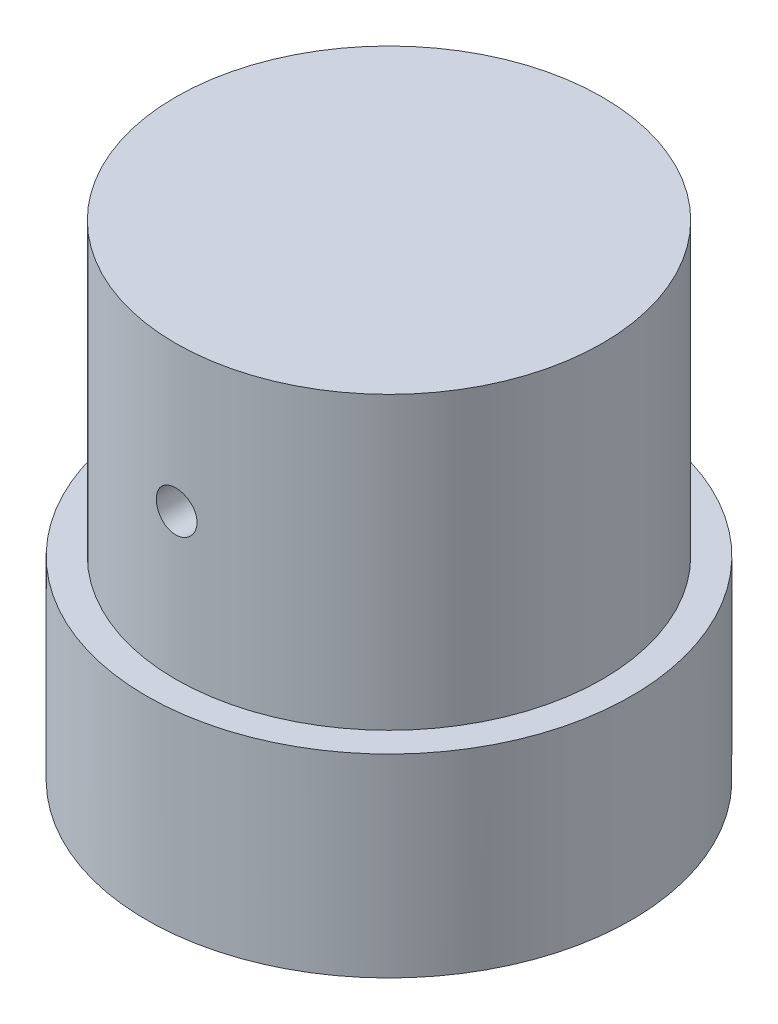
ISO-10303-21;
HEADER;
FILE_DESCRIPTION(('STEP AP214'),'2;1');
FILE_NAME('part.step','',(''),(''),'','','');
FILE_SCHEMA(('AUTOMOTIVE_DESIGN { 1 0 10303 214 1 1 1 1 }'));
ENDSEC;
DATA;
#1=APPLICATION_CONTEXT('core data for automotive mechanical design processes');
#2=APPLICATION_PROTOCOL_DEFINITION('international standard','automotive_design',2000,#1);
#3=PRODUCT_CONTEXT('',#1,'mechanical');
#4=PRODUCT('Part','Part','',(#3));
#5=PRODUCT_RELATED_PRODUCT_CATEGORY('part','',(#4));
#6=PRODUCT_DEFINITION_FORMATION('','',#4);
#7=PRODUCT_DEFINITION_CONTEXT('part definition',#1,'design');
#8=PRODUCT_DEFINITION('design','',#6,#7);
#9=PRODUCT_DEFINITION_SHAPE('','',#8);
#10=(LENGTH_UNIT() NAMED_UNIT(*) SI_UNIT(.MILLI.,.METRE.));
#11=(NAMED_UNIT(*) PLANE_ANGLE_UNIT() SI_UNIT($,.RADIAN.));
#12=(NAMED_UNIT(*) SI_UNIT($,.STERADIAN.) SOLID_ANGLE_UNIT());
#13=UNCERTAINTY_MEASURE_WITH_UNIT(LENGTH_MEASURE(1.E-05),#10,'distance_accuracy_value','');
#14=(GEOMETRIC_REPRESENTATION_CONTEXT(3) GLOBAL_UNCERTAINTY_ASSIGNED_CONTEXT((#13)) GLOBAL_UNIT_ASSIGNED_CONTEXT((#10,
#11,#12)) REPRESENTATION_CONTEXT('',''));
#15=CARTESIAN_POINT('',(0.,0.,0.));
#16=DIRECTION('',(0.,0.,1.));
#17=DIRECTION('',(1.,0.,0.));
#18=AXIS2_PLACEMENT_3D('',#15,#16,#17);
#19=CARTESIAN_POINT('',(0.,0.,0.));
#20=DIRECTION('',(0.,1.,0.));
#21=DIRECTION('',(0.,0.,1.));
#22=AXIS2_PLACEMENT_3D('',#19,#20,#21);
#23=PLANE('',#22);
#24=CARTESIAN_POINT('',(0.,0.,0.));
#25=DIRECTION('',(0.,1.,0.));
#26=DIRECTION('',(0.,0.,1.));
#27=AXIS2_PLACEMENT_3D('',#24,#25,#26);
#28=CIRCLE('',#27,22.);
#29=CARTESIAN_POINT('',(0.,0.,22.));
#30=VERTEX_POINT('',#29);
#31=EDGE_CURVE('E54',#30,#30,#28,.T.);
#32=ORIENTED_EDGE('',*,*,#31,.F.);
#33=EDGE_LOOP('',(#32));
#34=FACE_BOUND('',#33,.T.);
#35=CARTESIAN_POINT('',(0.,0.,0.));
#36=DIRECTION('',(0.,1.,0.));
#37=DIRECTION('',(0.,0.,1.));
#38=AXIS2_PLACEMENT_3D('',#35,#36,#37);
#39=CIRCLE('',#38,25.);
#40=CARTESIAN_POINT('',(0.,0.,25.));
#41=VERTEX_POINT('',#40);
#42=EDGE_CURVE('E72',#41,#41,#39,.F.);
#43=ORIENTED_EDGE('',*,*,#42,.F.);
#44=EDGE_LOOP('',(#43));
#45=FACE_BOUND('',#44,.T.);
#46=ADVANCED_FACE('F39',(#34,#45),#23,.T.);
#47=CARTESIAN_POINT('',(0.,30.,0.));
#48=DIRECTION('',(0.,-1.,0.));
#49=DIRECTION('',(0.,0.,-1.));
#50=AXIS2_PLACEMENT_3D('',#47,#48,#49);
#51=CYLINDRICAL_SURFACE('',#50,22.);
#52=CARTESIAN_POINT('',(0.,17.1,-22.));
#53=CARTESIAN_POINT('',(-0.117670645814914,17.0999948910125,-21.9999987013763));
#54=CARTESIAN_POINT('',(-0.235419760745063,17.0900764381388,-21.9990458874824));
#55=CARTESIAN_POINT('',(-0.467655439613249,17.0506584376767,-21.9953365419638));
#56=CARTESIAN_POINT('',(-0.582138232035176,17.0211371395112,-21.9925780068274));
#57=CARTESIAN_POINT('',(-0.804444497759614,16.9433790156769,-21.9855687064554));
#58=CARTESIAN_POINT('',(-0.912271875523864,16.8951532864621,-21.9813188261064));
#59=CARTESIAN_POINT('',(-1.1182773367849,16.7813763130188,-21.9718024497537));
#60=CARTESIAN_POINT('',(-1.21645737560882,16.7158285895977,-21.9665361604002));
#61=CARTESIAN_POINT('',(-1.40072877226069,16.5690362144771,-21.9555577881677));
#62=CARTESIAN_POINT('',(-1.4867839109137,16.4877461861308,-21.9498444457504));
#63=CARTESIAN_POINT('',(-1.64405155903287,16.3118732987609,-21.9386263555497));
#64=CARTESIAN_POINT('',(-1.71526339223751,16.2172898344164,-21.9331216172797));
#65=CARTESIAN_POINT('',(-1.84094979392621,16.0172901761749,-21.9229309621292));
#66=CARTESIAN_POINT('',(-1.89539183371362,15.9118534517175,-21.918246644129));
#67=CARTESIAN_POINT('',(-1.98578551567151,15.693282798778,-21.9102425198768));
#68=CARTESIAN_POINT('',(-2.0217375766356,15.5801490446976,-21.9069226827201));
#69=CARTESIAN_POINT('',(-2.07402397811972,15.3497635416911,-21.9020345891473));
#70=CARTESIAN_POINT('',(-2.09041812226497,15.2325254804613,-21.9004609941585));
#71=CARTESIAN_POINT('',(-2.10330815234073,14.9969520428632,-21.8992269038192));
#72=CARTESIAN_POINT('',(-2.09980451772256,14.8786166930035,-21.8995663623724));
#73=CARTESIAN_POINT('',(-2.07304777464853,14.6446193261675,-21.9021151553371));
#74=CARTESIAN_POINT('',(-2.04985987500415,14.5289497761141,-21.9043183157084));
#75=CARTESIAN_POINT('',(-1.98449423978665,14.303151736652,-21.9103366172808));
#76=CARTESIAN_POINT('',(-1.94231626824152,14.1930233161168,-21.9141517785127));
#77=CARTESIAN_POINT('',(-1.84009548913766,13.981227156886,-21.9229713166618));
#78=CARTESIAN_POINT('',(-1.78002365618659,13.8795735105442,-21.927977623044));
#79=CARTESIAN_POINT('',(-1.64374124862855,13.6877666536797,-21.938613695269));
#80=CARTESIAN_POINT('',(-1.56753024389644,13.597613749766,-21.9442434777263));
#81=CARTESIAN_POINT('',(-1.40076819145644,13.4309884953293,-21.9555196694384));
#82=CARTESIAN_POINT('',(-1.3101608109988,13.3545725108402,-21.9611660547254));
#83=CARTESIAN_POINT('',(-1.11737389429879,13.2180268334768,-21.9718178555538));
#84=CARTESIAN_POINT('',(-1.01519434676567,13.157897156493,-21.9768232704698));
#85=CARTESIAN_POINT('',(-0.802125246629912,13.0556335783961,-21.9856305906562));
#86=CARTESIAN_POINT('',(-0.691234364038198,13.0135024315258,-21.9894323117072));
#87=CARTESIAN_POINT('',(-0.463908327389865,12.9484726351079,-21.9954019538068));
#88=CARTESIAN_POINT('',(-0.347473324457828,12.9255734616416,-21.9975699193622));
#89=CARTESIAN_POINT('',(-0.11285246854115,12.8997288993966,-22.0000220647216));
#90=CARTESIAN_POINT('',(0.00532474057174705,12.8967057078631,-22.0003135895907));
#91=CARTESIAN_POINT('',(0.240504195887224,12.9104947340843,-21.9989996793007));
#92=CARTESIAN_POINT('',(0.357506456512735,12.9273067080539,-21.9973942674558));
#93=CARTESIAN_POINT('',(0.586790979559205,12.9802243062501,-21.9924716378618));
#94=CARTESIAN_POINT('',(0.699081700090508,13.0162936078287,-21.9891576431978));
#95=CARTESIAN_POINT('',(0.916018269347612,13.1066647250299,-21.9811897751721));
#96=CARTESIAN_POINT('',(1.02066396112045,13.160966914847,-21.9765358743117));
#97=CARTESIAN_POINT('',(1.21969240554897,13.2864560655619,-21.966390786667));
#98=CARTESIAN_POINT('',(1.31404271956787,13.3576942676449,-21.9608970773462));
#99=CARTESIAN_POINT('',(1.48947405472278,13.5149596216251,-21.9496972445817));
#100=CARTESIAN_POINT('',(1.57055477273558,13.6009871112686,-21.9439911162893));
#101=CARTESIAN_POINT('',(1.71741452674698,13.7857279768693,-21.932987563299));
#102=CARTESIAN_POINT('',(1.7831425846645,13.8844819729074,-21.9276915381785));
#103=CARTESIAN_POINT('',(1.89708105876658,14.0916717052726,-21.9181287181457));
#104=CARTESIAN_POINT('',(1.94529169598214,14.2001073194175,-21.9138619102472));
#105=CARTESIAN_POINT('',(2.02274102753929,14.423405723614,-21.9068491322981));
#106=CARTESIAN_POINT('',(2.05201030745915,14.538257825148,-21.9041007114857));
#107=CARTESIAN_POINT('',(2.09084541759702,14.7712738979477,-21.9004281236332));
#108=CARTESIAN_POINT('',(2.10041175832258,14.889437783324,-21.8995039093275));
#109=CARTESIAN_POINT('',(2.09956270256684,15.1252165280071,-21.8995852882195));
#110=CARTESIAN_POINT('',(2.0892273899256,15.2428316865966,-21.9005831470398));
#111=CARTESIAN_POINT('',(2.04903605442495,15.4746469996046,-21.9043797645544));
#112=CARTESIAN_POINT('',(2.0191800071133,15.5888471497452,-21.9071785255046));
#113=CARTESIAN_POINT('',(1.94081629390877,15.8105917720863,-21.9142594848844));
#114=CARTESIAN_POINT('',(1.89231072305608,15.9181369903102,-21.9185415166818));
#115=CARTESIAN_POINT('',(1.77803327888449,16.1235718301179,-21.9281068720984));
#116=CARTESIAN_POINT('',(1.71226155263309,16.2214615339347,-21.9333901871888));
#117=CARTESIAN_POINT('',(1.56501783174587,16.405216985766,-21.9443882410729));
#118=CARTESIAN_POINT('',(1.48348623292811,16.4910348786764,-21.9501045659573));
#119=CARTESIAN_POINT('',(1.30715295707972,16.6478077282489,-21.9613100423585));
#120=CARTESIAN_POINT('',(1.21234809708957,16.7187591096675,-21.9667991389751));
#121=CARTESIAN_POINT('',(1.01192153847655,16.843911895116,-21.9769447230228));
#122=CARTESIAN_POINT('',(0.906275211270257,16.8980739852236,-21.9815992456342));
#123=CARTESIAN_POINT('',(0.687411952443564,16.9878186118767,-21.9895294792417));
#124=CARTESIAN_POINT('',(0.574203770499703,17.0234222159333,-21.9928067528618));
#125=CARTESIAN_POINT('',(0.38362226149571,17.0661060839411,-21.9967845493608));
#126=CARTESIAN_POINT('',(0.307469452732087,17.0787990742759,-21.997984759528));
#127=CARTESIAN_POINT('',(0.154222331064705,17.0957476911556,-21.999592908987));
#128=CARTESIAN_POINT('',(0.0771280216234363,17.1000033487204,-22.0000008511917));
#129=CARTESIAN_POINT('',(0.,17.1,-22.));
#130=B_SPLINE_CURVE_WITH_KNOTS('',3,(#52,#53,#54,#55,#56,#57,#58,#59,#60,#61,#62,#63,#64,#65,
#66,#67,#68,#69,#70,#71,#72,#73,#74,#75,#76,#77,#78,#79,#80,#81,#82,#83,#84,#85,#86,#87,#88,#89,
#90,#91,#92,#93,#94,#95,#96,#97,#98,#99,#100,#101,#102,#103,#104,#105,#106,#107,#108,#109,#110,
#111,#112,#113,#114,#115,#116,#117,#118,#119,#120,#121,#122,#123,#124,#125,#126,#127,#128,#129),
.UNSPECIFIED.,.T.,.F.,(4,2,2,2,2,2,2,2,2,2,2,2,2,2,2,2,2,2,2,2,2,2,2,2,2,2,2,2,2,2,2,2,2,2,2,2,
2,2,4),(0.,0.352730306829124,0.70585264533314,1.05876581270704,1.41160730329569,
1.76548140670438,2.11937162910736,2.47394403833499,2.82850841622852,3.18198581569252,
3.53545469789965,3.88775717939567,4.24006403874857,4.59294551148298,4.94583639004677,
5.30014376601363,5.65445148767421,6.00881340821855,6.36316567490062,6.71613003121023,
7.06909004944131,7.42138666393257,7.77369050906606,8.127074154604,8.4804658715136,
8.83501484431691,9.18955934334295,9.54352990321352,9.89749129151223,10.2500313225286,
10.6025717951478,10.9550726758298,11.3075705541214,11.6614286361329,12.0153717199579,
12.3701374455975,12.7244995608397,12.9556998790288,13.186899347205),.UNSPECIFIED.);
#131=CARTESIAN_POINT('',(0.,17.1,-22.));
#132=VERTEX_POINT('',#131);
#133=EDGE_CURVE('E44',#132,#132,#130,.T.);
#134=ORIENTED_EDGE('',*,*,#133,.T.);
#135=EDGE_LOOP('',(#134));
#136=FACE_BOUND('',#135,.T.);
#137=CARTESIAN_POINT('',(2.09999999999999,15.,21.899543374235));
#138=CARTESIAN_POINT('',(2.09999488977837,14.8823307311834,21.8995446950595));
#139=CARTESIAN_POINT('',(2.090076661193,14.7645829888826,21.9005019717894));
#140=CARTESIAN_POINT('',(2.05065963261122,14.5323501619767,21.9042272597282));
#141=CARTESIAN_POINT('',(2.02113907728451,14.417868849966,21.9069972827351));
#142=CARTESIAN_POINT('',(1.94338312651059,14.195565714516,21.9140315014693));
#143=CARTESIAN_POINT('',(1.89515886284916,14.0877399740793,21.918294808301));
#144=CARTESIAN_POINT('',(1.78138534062543,13.8817372559516,21.9278341283342));
#145=CARTESIAN_POINT('',(1.71583959926926,13.7835583249771,21.9331099358833));
#146=CARTESIAN_POINT('',(1.56904922580788,13.5992856760903,21.944099471279));
#147=CARTESIAN_POINT('',(1.4877587742889,13.5132285285563,21.9498144471525));
#148=CARTESIAN_POINT('',(1.31188419726634,13.3559570036286,21.9610270301211));
#149=CARTESIAN_POINT('',(1.21729947192167,13.2847432963351,21.9665246273939));
#150=CARTESIAN_POINT('',(1.0172987100787,13.1590549358915,21.9766952243965));
#151=CARTESIAN_POINT('',(0.911862359857689,13.1046124669697,21.9813666314335));
#152=CARTESIAN_POINT('',(0.693292520350492,13.0142178883771,21.98934495951));
#153=CARTESIAN_POINT('',(0.580159203343522,12.9782653650047,21.992651911078));
#154=CARTESIAN_POINT('',(0.349775033307473,12.9259779958174,21.9975199740452));
#155=CARTESIAN_POINT('',(0.23253787650548,12.9095833064338,21.999086410105));
#156=CARTESIAN_POINT('',(-0.00303379062485895,12.8966918725279,22.0003150389461));
#157=CARTESIAN_POINT('',(-0.121368274769751,12.9001946544431,21.9999772770476));
#158=CARTESIAN_POINT('',(-0.355369405717917,12.9269500488188,21.997439934616));
#159=CARTESIAN_POINT('',(-0.471043485230894,12.95013831079,21.9952464204906));
#160=CARTESIAN_POINT('',(-0.696850396588129,13.0155062412083,21.9892511199231));
#161=CARTESIAN_POINT('',(-0.806983161950447,13.0576861374473,21.9854493141906));
#162=CARTESIAN_POINT('',(-1.01878458286487,13.1599108990208,21.976654505035));
#163=CARTESIAN_POINT('',(-1.12043936421984,13.2199843402263,21.9716595987848));
#164=CARTESIAN_POINT('',(-1.3122478087796,13.3562701788177,21.9610393067591));
#165=CARTESIAN_POINT('',(-1.40240116476572,13.432483007164,21.9554139041497));
#166=CARTESIAN_POINT('',(-1.56902435433947,13.5992463514057,21.9441376951972));
#167=CARTESIAN_POINT('',(-1.64543819024725,13.6898528281612,21.9384868770031));
#168=CARTESIAN_POINT('',(-1.78197996340134,13.8826371718511,21.927819154083));
#169=CARTESIAN_POINT('',(-1.84210788032567,13.9848150532245,21.922802250148));
#170=CARTESIAN_POINT('',(-1.9443701929479,14.1978837056774,21.9139698003308));
#171=CARTESIAN_POINT('',(-1.98650129021459,14.308776069529,21.9101544747059));
#172=CARTESIAN_POINT('',(-2.05153053335044,14.5361053253377,21.904161667555));
#173=CARTESIAN_POINT('',(-2.07442921210353,14.652542063579,21.9019841406497));
#174=CARTESIAN_POINT('',(-2.10027190895526,14.887163720881,21.8995212047894));
#175=CARTESIAN_POINT('',(-2.10329419471058,15.0053399443542,21.8992283745254));
#176=CARTESIAN_POINT('',(-2.08950370875862,15.2405172106584,21.9005484030581));
#177=CARTESIAN_POINT('',(-2.07269118085208,15.3575182679161,21.9021612384312));
#178=CARTESIAN_POINT('',(-2.01977372857274,15.5867968347858,21.907104117184));
#179=CARTESIAN_POINT('',(-1.98370567198954,15.6990829302575,21.9104308785539));
#180=CARTESIAN_POINT('',(-1.89333859411948,15.9160108003545,21.9184240891023));
#181=CARTESIAN_POINT('',(-1.83903919130177,16.0206524149465,21.9230905663168));
#182=CARTESIAN_POINT('',(-1.71355413811984,16.2196780894939,21.9332553893251));
#183=CARTESIAN_POINT('',(-1.64231653841289,16.3140292638356,21.9387562750725));
#184=CARTESIAN_POINT('',(-1.48505188928668,16.4894626154917,21.9499617140258));
#185=CARTESIAN_POINT('',(-1.39902450629534,16.5705444934467,21.9556662718231));
#186=CARTESIAN_POINT('',(-1.21428313261087,16.7174067424166,21.9666586116381));
#187=CARTESIAN_POINT('',(-1.11552850323793,16.7831361147078,21.9719449670532));
#188=CARTESIAN_POINT('',(-0.90833715482383,16.8970768951778,21.9814845669791));
#189=CARTESIAN_POINT('',(-0.799900558166664,16.945288524749,21.9857378245461));
#190=CARTESIAN_POINT('',(-0.576602783544367,17.0227385150936,21.9927255253493));
#191=CARTESIAN_POINT('',(-0.461752444007935,17.0520078913954,21.995462450324));
#192=CARTESIAN_POINT('',(-0.22874008636551,17.0908437913878,21.9991192622745));
#193=CARTESIAN_POINT('',(-0.110578152562185,17.1004108161767,22.0000391954626));
#194=CARTESIAN_POINT('',(0.125201775421535,17.0995637511373,21.9999583768054));
#195=CARTESIAN_POINT('',(0.24282006502012,17.0892289204443,21.9989652437412));
#196=CARTESIAN_POINT('',(0.474641760112532,17.0490374471882,21.9951849188665));
#197=CARTESIAN_POINT('',(0.588845162297597,17.0191807857107,21.9923977253178));
#198=CARTESIAN_POINT('',(0.810596286050116,16.9408146224546,21.98534168487));
#199=CARTESIAN_POINT('',(0.918144743921951,16.8923071885005,21.9810730022297));
#200=CARTESIAN_POINT('',(1.12358528521902,16.7780250155512,21.9715303165089));
#201=CARTESIAN_POINT('',(1.22147745288398,16.7122504272098,21.9662563221997));
#202=CARTESIAN_POINT('',(1.40523274931803,16.5650035633045,21.9552690811215));
#203=CARTESIAN_POINT('',(1.49104854528123,16.4834723378118,21.9495542348238));
#204=CARTESIAN_POINT('',(1.64781733849726,16.3071406707426,21.9383429689997));
#205=CARTESIAN_POINT('',(1.71876675501917,16.2123370415132,21.9328466023544));
#206=CARTESIAN_POINT('',(1.84391743144759,16.0119114808242,21.9226807741383));
#207=CARTESIAN_POINT('',(1.89807902300979,15.9062646994873,21.9180132820725));
#208=CARTESIAN_POINT('',(1.98782259170001,15.6874004763957,21.9100572745046));
#209=CARTESIAN_POINT('',(2.02342564319974,15.5741917872559,21.9067671957042));
#210=CARTESIAN_POINT('',(2.06610795049813,15.383611757265,21.9027730352437));
#211=CARTESIAN_POINT('',(2.07880023842232,15.3074610450616,21.9015675930699));
#212=CARTESIAN_POINT('',(2.09574792215155,15.1542181238963,21.8999523311868));
#213=CARTESIAN_POINT('',(2.10000334947722,15.077125918453,21.8995425085051));
#214=CARTESIAN_POINT('',(2.09999999999999,15.,21.899543374235));
#215=B_SPLINE_CURVE_WITH_KNOTS('',3,(#137,#138,#139,#140,#141,#142,#143,#144,#145,#146,#147,
#148,#149,#150,#151,#152,#153,#154,#155,#156,#157,#158,#159,#160,#161,#162,#163,#164,#165,#166,
#167,#168,#169,#170,#171,#172,#173,#174,#175,#176,#177,#178,#179,#180,#181,#182,#183,#184,#185,
#186,#187,#188,#189,#190,#191,#192,#193,#194,#195,#196,#197,#198,#199,#200,#201,#202,#203,#204,
#205,#206,#207,#208,#209,#210,#211,#212,#213,#214),.UNSPECIFIED.,.T.,.F.,(4,2,2,2,2,2,2,2,2,2,2,
2,2,2,2,2,2,2,2,2,2,2,2,2,2,2,2,2,2,2,2,2,2,2,2,2,2,2,4),(0.,0.352726170724816,
0.705844464730878,1.05875291692207,1.41158976440809,1.76546928023515,2.11936476832722,
2.47393521568496,2.82849772939326,3.18197253777319,3.53543893344249,3.88775430119042,
4.24007389483599,4.59295918502802,4.94585389929211,5.3001558101873,5.65445816318712,
6.00882542437941,6.36318286658572,6.71614410886539,7.06910101274718,7.42138453518095,
7.77367543037868,8.12706106258721,8.48045466617997,8.83500600511655,9.18955286301484,
9.54351771689086,9.89747356811664,10.250022704995,10.6025721834553,10.9550825857682,
11.3075899125725,11.6614425315455,12.015380282088,12.3701480946595,12.7245121639273,
12.9557061858732,13.1868993440626),.UNSPECIFIED.);
#216=CARTESIAN_POINT('',(2.09999999999999,15.,21.899543374235));
#217=VERTEX_POINT('',#216);
#218=EDGE_CURVE('E85',#217,#217,#215,.T.);
#219=ORIENTED_EDGE('',*,*,#218,.T.);
#220=EDGE_LOOP('',(#219));
#221=FACE_BOUND('',#220,.T.);
#222=CARTESIAN_POINT('',(0.,30.,0.));
#223=DIRECTION('',(0.,1.,0.));
#224=DIRECTION('',(0.,0.,1.));
#225=AXIS2_PLACEMENT_3D('',#222,#223,#224);
#226=CIRCLE('',#225,22.);
#227=CARTESIAN_POINT('',(0.,30.,22.));
#228=VERTEX_POINT('',#227);
#229=EDGE_CURVE('E11',#228,#228,#226,.T.);
#230=ORIENTED_EDGE('',*,*,#229,.F.);
#231=EDGE_LOOP('',(#230));
#232=FACE_BOUND('',#231,.T.);
#233=ORIENTED_EDGE('',*,*,#31,.T.);
#234=EDGE_LOOP('',(#233));
#235=FACE_BOUND('',#234,.T.);
#236=ADVANCED_FACE('F41',(#136,#221,#232,#235),#51,.T.);
#237=CARTESIAN_POINT('',(0.,30.,0.));
#238=DIRECTION('',(0.,1.,0.));
#239=DIRECTION('',(0.,0.,1.));
#240=AXIS2_PLACEMENT_3D('',#237,#238,#239);
#241=PLANE('',#240);
#242=ORIENTED_EDGE('',*,*,#229,.T.);
#243=EDGE_LOOP('',(#242));
#244=FACE_BOUND('',#243,.T.);
#245=ADVANCED_FACE('F100',(#244),#241,.T.);
#246=CARTESIAN_POINT('',(0.,15.,25.8));
#247=DIRECTION('',(0.,0.,1.));
#248=DIRECTION('',(1.,0.,0.));
#249=AXIS2_PLACEMENT_3D('',#246,#247,#248);
#250=CYLINDRICAL_SURFACE('',#249,2.09999999999999);
#251=CARTESIAN_POINT('',(0.,15.,10.8));
#252=DIRECTION('',(0.,0.,1.));
#253=DIRECTION('',(1.,0.,0.));
#254=AXIS2_PLACEMENT_3D('',#251,#252,#253);
#255=CIRCLE('',#254,2.1);
#256=CARTESIAN_POINT('',(2.1,15.,10.8));
#257=VERTEX_POINT('',#256);
#258=EDGE_CURVE('E77',#257,#257,#255,.T.);
#259=ORIENTED_EDGE('',*,*,#258,.F.);
#260=EDGE_LOOP('',(#259));
#261=FACE_BOUND('',#260,.T.);
#262=ORIENTED_EDGE('',*,*,#218,.F.);
#263=EDGE_LOOP('',(#262));
#264=FACE_BOUND('',#263,.T.);
#265=ADVANCED_FACE('F95',(#261,#264),#250,.F.);
#266=CARTESIAN_POINT('',(0.,15.,10.8));
#267=DIRECTION('',(0.,0.,1.));
#268=DIRECTION('',(1.,0.,0.));
#269=AXIS2_PLACEMENT_3D('',#266,#267,#268);
#270=CONICAL_SURFACE('',#269,2.1,1.02974425867665);
#271=CARTESIAN_POINT('',(0.,15.,9.53819270004213));
#272=VERTEX_POINT('',#271);
#273=VERTEX_LOOP('',#272);
#274=FACE_BOUND('',#273,.T.);
#275=ORIENTED_EDGE('',*,*,#258,.T.);
#276=EDGE_LOOP('',(#275));
#277=FACE_BOUND('',#276,.T.);
#278=ADVANCED_FACE('F99',(#274,#277),#270,.F.);
#279=CARTESIAN_POINT('',(0.,15.,-25.8));
#280=DIRECTION('',(0.,0.,-1.));
#281=DIRECTION('',(-1.,0.,0.));
#282=AXIS2_PLACEMENT_3D('',#279,#280,#281);
#283=CYLINDRICAL_SURFACE('',#282,2.09999999999999);
#284=CARTESIAN_POINT('',(0.,15.,-10.8));
#285=DIRECTION('',(0.,0.,-1.));
#286=DIRECTION('',(-1.,0.,0.));
#287=AXIS2_PLACEMENT_3D('',#284,#285,#286);
#288=CIRCLE('',#287,2.1);
#289=CARTESIAN_POINT('',(-2.1,15.,-10.8));
#290=VERTEX_POINT('',#289);
#291=EDGE_CURVE('E69',#290,#290,#288,.T.);
#292=ORIENTED_EDGE('',*,*,#291,.F.);
#293=EDGE_LOOP('',(#292));
#294=FACE_BOUND('',#293,.T.);
#295=ORIENTED_EDGE('',*,*,#133,.F.);
#296=EDGE_LOOP('',(#295));
#297=FACE_BOUND('',#296,.T.);
#298=ADVANCED_FACE('F65',(#294,#297),#283,.F.);
#299=CARTESIAN_POINT('',(0.,15.,-10.8));
#300=DIRECTION('',(0.,0.,-1.));
#301=DIRECTION('',(-1.,0.,0.));
#302=AXIS2_PLACEMENT_3D('',#299,#300,#301);
#303=CONICAL_SURFACE('',#302,2.1,1.02974425867665);
#304=CARTESIAN_POINT('',(0.,15.,-9.53819270004213));
#305=VERTEX_POINT('',#304);
#306=VERTEX_LOOP('',#305);
#307=FACE_BOUND('',#306,.T.);
#308=ORIENTED_EDGE('',*,*,#291,.T.);
#309=EDGE_LOOP('',(#308));
#310=FACE_BOUND('',#309,.T.);
#311=ADVANCED_FACE('F61',(#307,#310),#303,.F.);
#312=CARTESIAN_POINT('',(0.,30.001,0.));
#313=DIRECTION('',(0.,-1.,0.));
#314=DIRECTION('',(0.,0.,-1.));
#315=AXIS2_PLACEMENT_3D('',#312,#313,#314);
#316=CYLINDRICAL_SURFACE('',#315,25.);
#317=ORIENTED_EDGE('',*,*,#42,.T.);
#318=EDGE_LOOP('',(#317));
#319=FACE_BOUND('',#318,.T.);
#320=CARTESIAN_POINT('',(0.,-20.,0.));
#321=DIRECTION('',(0.,-1.,0.));
#322=DIRECTION('',(0.,0.,-1.));
#323=AXIS2_PLACEMENT_3D('',#320,#321,#322);
#324=CIRCLE('',#323,25.);
#325=CARTESIAN_POINT('',(0.,-20.,-25.));
#326=VERTEX_POINT('',#325);
#327=EDGE_CURVE('E79',#326,#326,#324,.T.);
#328=ORIENTED_EDGE('',*,*,#327,.F.);
#329=EDGE_LOOP('',(#328));
#330=FACE_BOUND('',#329,.T.);
#331=ADVANCED_FACE('F64',(#319,#330),#316,.T.);
#332=CARTESIAN_POINT('',(0.,-20.,0.));
#333=DIRECTION('',(0.,1.,0.));
#334=DIRECTION('',(0.,0.,1.));
#335=AXIS2_PLACEMENT_3D('',#332,#333,#334);
#336=PLANE('',#335);
#337=CARTESIAN_POINT('',(-8.83883476483183,-20.,8.83883476483186));
#338=DIRECTION('',(0.,-1.,0.));
#339=DIRECTION('',(0.,0.,1.));
#340=AXIS2_PLACEMENT_3D('',#337,#338,#339);
#341=CIRCLE('',#340,2.5);
#342=CARTESIAN_POINT('',(-8.83883476483183,-20.,11.3388347648319));
#343=VERTEX_POINT('',#342);
#344=EDGE_CURVE('E150',#343,#343,#341,.T.);
#345=ORIENTED_EDGE('',*,*,#344,.F.);
#346=EDGE_LOOP('',(#345));
#347=FACE_BOUND('',#346,.T.);
#348=CARTESIAN_POINT('',(8.83883476483183,-20.,-8.83883476483186));
#349=DIRECTION('',(0.,-1.,0.));
#350=DIRECTION('',(0.,0.,1.));
#351=AXIS2_PLACEMENT_3D('',#348,#349,#350);
#352=CIRCLE('',#351,2.5);
#353=CARTESIAN_POINT('',(8.83883476483183,-20.,-6.33883476483186));
#354=VERTEX_POINT('',#353);
#355=EDGE_CURVE('E141',#354,#354,#352,.T.);
#356=ORIENTED_EDGE('',*,*,#355,.F.);
#357=EDGE_LOOP('',(#356));
#358=FACE_BOUND('',#357,.T.);
#359=CARTESIAN_POINT('',(-8.83883476483183,-20.,-8.83883476483186));
#360=DIRECTION('',(0.,-1.,0.));
#361=DIRECTION('',(0.,0.,-1.));
#362=AXIS2_PLACEMENT_3D('',#359,#360,#361);
#363=CIRCLE('',#362,2.5);
#364=CARTESIAN_POINT('',(-8.83883476483183,-20.,-11.3388347648319));
#365=VERTEX_POINT('',#364);
#366=EDGE_CURVE('E157',#365,#365,#363,.T.);
#367=ORIENTED_EDGE('',*,*,#366,.F.);
#368=EDGE_LOOP('',(#367));
#369=FACE_BOUND('',#368,.T.);
#370=CARTESIAN_POINT('',(8.83883476483183,-20.,8.83883476483186));
#371=DIRECTION('',(0.,-1.,0.));
#372=DIRECTION('',(0.,0.,-1.));
#373=AXIS2_PLACEMENT_3D('',#370,#371,#372);
#374=CIRCLE('',#373,2.5);
#375=CARTESIAN_POINT('',(8.83883476483183,-20.,6.33883476483186));
#376=VERTEX_POINT('',#375);
#377=EDGE_CURVE('E134',#376,#376,#374,.T.);
#378=ORIENTED_EDGE('',*,*,#377,.F.);
#379=EDGE_LOOP('',(#378));
#380=FACE_BOUND('',#379,.T.);
#381=ORIENTED_EDGE('',*,*,#327,.T.);
#382=EDGE_LOOP('',(#381));
#383=FACE_BOUND('',#382,.T.);
#384=ADVANCED_FACE('F104',(#347,#358,#369,#380,#383),#336,.F.);
#385=CARTESIAN_POINT('',(8.83883476483183,-5.,8.83883476483186));
#386=DIRECTION('',(0.,-1.,0.));
#387=DIRECTION('',(0.,0.,-1.));
#388=AXIS2_PLACEMENT_3D('',#385,#386,#387);
#389=CYLINDRICAL_SURFACE('',#388,2.5);
#390=CARTESIAN_POINT('',(8.83883476483183,-5.,8.83883476483186));
#391=DIRECTION('',(0.,-1.,0.));
#392=DIRECTION('',(0.,0.,-1.));
#393=AXIS2_PLACEMENT_3D('',#390,#391,#392);
#394=CIRCLE('',#393,2.5);
#395=CARTESIAN_POINT('',(8.83883476483183,-5.,6.33883476483186));
#396=VERTEX_POINT('',#395);
#397=EDGE_CURVE('E131',#396,#396,#394,.T.);
#398=ORIENTED_EDGE('',*,*,#397,.F.);
#399=EDGE_LOOP('',(#398));
#400=FACE_BOUND('',#399,.T.);
#401=ORIENTED_EDGE('',*,*,#377,.T.);
#402=EDGE_LOOP('',(#401));
#403=FACE_BOUND('',#402,.T.);
#404=ADVANCED_FACE('F107',(#400,#403),#389,.F.);
#405=CARTESIAN_POINT('',(8.83883476483183,-5.,8.83883476483186));
#406=DIRECTION('',(0.,-1.,0.));
#407=DIRECTION('',(0.,0.,-1.));
#408=AXIS2_PLACEMENT_3D('',#405,#406,#407);
#409=PLANE('',#408);
#410=ORIENTED_EDGE('',*,*,#397,.T.);
#411=EDGE_LOOP('',(#410));
#412=FACE_BOUND('',#411,.T.);
#413=ADVANCED_FACE('F170',(#412),#409,.T.);
#414=CARTESIAN_POINT('',(-8.83883476483183,-5.,-8.83883476483186));
#415=DIRECTION('',(0.,-1.,0.));
#416=DIRECTION('',(0.,0.,-1.));
#417=AXIS2_PLACEMENT_3D('',#414,#415,#416);
#418=CYLINDRICAL_SURFACE('',#417,2.5);
#419=CARTESIAN_POINT('',(-8.83883476483183,-5.,-8.83883476483186));
#420=DIRECTION('',(0.,-1.,0.));
#421=DIRECTION('',(0.,0.,-1.));
#422=AXIS2_PLACEMENT_3D('',#419,#420,#421);
#423=CIRCLE('',#422,2.5);
#424=CARTESIAN_POINT('',(-8.83883476483183,-5.,-11.3388347648319));
#425=VERTEX_POINT('',#424);
#426=EDGE_CURVE('E146',#425,#425,#423,.T.);
#427=ORIENTED_EDGE('',*,*,#426,.F.);
#428=EDGE_LOOP('',(#427));
#429=FACE_BOUND('',#428,.T.);
#430=ORIENTED_EDGE('',*,*,#366,.T.);
#431=EDGE_LOOP('',(#430));
#432=FACE_BOUND('',#431,.T.);
#433=ADVANCED_FACE('F167',(#429,#432),#418,.F.);
#434=CARTESIAN_POINT('',(-8.83883476483183,-5.,-8.83883476483186));
#435=DIRECTION('',(0.,-1.,0.));
#436=DIRECTION('',(0.,0.,-1.));
#437=AXIS2_PLACEMENT_3D('',#434,#435,#436);
#438=PLANE('',#437);
#439=ORIENTED_EDGE('',*,*,#426,.T.);
#440=EDGE_LOOP('',(#439));
#441=FACE_BOUND('',#440,.T.);
#442=ADVANCED_FACE('F165',(#441),#438,.T.);
#443=CARTESIAN_POINT('',(8.83883476483183,-5.,-8.83883476483186));
#444=DIRECTION('',(0.,-1.,0.));
#445=DIRECTION('',(0.,0.,-1.));
#446=AXIS2_PLACEMENT_3D('',#443,#444,#445);
#447=CYLINDRICAL_SURFACE('',#446,2.5);
#448=CARTESIAN_POINT('',(8.83883476483183,-5.,-8.83883476483186));
#449=DIRECTION('',(0.,-1.,0.));
#450=DIRECTION('',(0.,0.,1.));
#451=AXIS2_PLACEMENT_3D('',#448,#449,#450);
#452=CIRCLE('',#451,2.5);
#453=CARTESIAN_POINT('',(8.83883476483183,-5.,-6.33883476483186));
#454=VERTEX_POINT('',#453);
#455=EDGE_CURVE('E145',#454,#454,#452,.T.);
#456=ORIENTED_EDGE('',*,*,#455,.F.);
#457=EDGE_LOOP('',(#456));
#458=FACE_BOUND('',#457,.T.);
#459=ORIENTED_EDGE('',*,*,#355,.T.);
#460=EDGE_LOOP('',(#459));
#461=FACE_BOUND('',#460,.T.);
#462=ADVANCED_FACE('F238',(#458,#461),#447,.F.);
#463=CARTESIAN_POINT('',(8.83883476483183,-5.,-8.83883476483186));
#464=DIRECTION('',(0.,1.,0.));
#465=DIRECTION('',(0.,0.,1.));
#466=AXIS2_PLACEMENT_3D('',#463,#464,#465);
#467=PLANE('',#466);
#468=ORIENTED_EDGE('',*,*,#455,.T.);
#469=EDGE_LOOP('',(#468));
#470=FACE_BOUND('',#469,.T.);
#471=ADVANCED_FACE('F247',(#470),#467,.F.);
#472=CARTESIAN_POINT('',(-8.83883476483183,-5.,8.83883476483186));
#473=DIRECTION('',(0.,-1.,0.));
#474=DIRECTION('',(0.,0.,-1.));
#475=AXIS2_PLACEMENT_3D('',#472,#473,#474);
#476=CYLINDRICAL_SURFACE('',#475,2.5);
#477=CARTESIAN_POINT('',(-8.83883476483183,-5.,8.83883476483186));
#478=DIRECTION('',(0.,-1.,0.));
#479=DIRECTION('',(0.,0.,1.));
#480=AXIS2_PLACEMENT_3D('',#477,#478,#479);
#481=CIRCLE('',#480,2.5);
#482=CARTESIAN_POINT('',(-8.83883476483183,-5.,11.3388347648319));
#483=VERTEX_POINT('',#482);
#484=EDGE_CURVE('E139',#483,#483,#481,.T.);
#485=ORIENTED_EDGE('',*,*,#484,.F.);
#486=EDGE_LOOP('',(#485));
#487=FACE_BOUND('',#486,.T.);
#488=ORIENTED_EDGE('',*,*,#344,.T.);
#489=EDGE_LOOP('',(#488));
#490=FACE_BOUND('',#489,.T.);
#491=ADVANCED_FACE('F256',(#487,#490),#476,.F.);
#492=CARTESIAN_POINT('',(-8.83883476483183,-5.,8.83883476483186));
#493=DIRECTION('',(0.,1.,0.));
#494=DIRECTION('',(0.,0.,1.));
#495=AXIS2_PLACEMENT_3D('',#492,#493,#494);
#496=PLANE('',#495);
#497=ORIENTED_EDGE('',*,*,#484,.T.);
#498=EDGE_LOOP('',(#497));
#499=FACE_BOUND('',#498,.T.);
#500=ADVANCED_FACE('F266',(#499),#496,.F.);
#501=CLOSED_SHELL('',(#46,#236,#245,#265,#278,#298,#311,#331,#384,#404,#413,#433,#442,#462,#471,
#491,#500));
#502=MANIFOLD_SOLID_BREP('B2',#501);
#503=ADVANCED_BREP_SHAPE_REPRESENTATION('',(#18,#502),#14);
#504=SHAPE_DEFINITION_REPRESENTATION(#9,#503);
ENDSEC;
END-ISO-10303-21;
